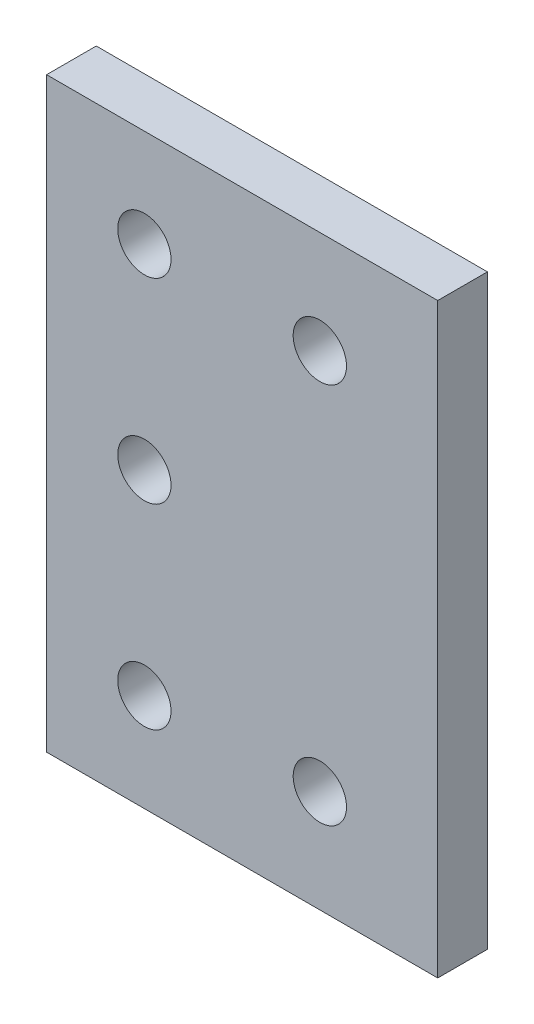
ISO-10303-21;
HEADER;
FILE_DESCRIPTION(('STEP AP214'),'2;1');
FILE_NAME('part.step','',(''),(''),'','','');
FILE_SCHEMA(('AUTOMOTIVE_DESIGN { 1 0 10303 214 1 1 1 1 }'));
ENDSEC;
DATA;
#1=APPLICATION_CONTEXT('core data for automotive mechanical design processes');
#2=APPLICATION_PROTOCOL_DEFINITION('international standard','automotive_design',2000,#1);
#3=PRODUCT_CONTEXT('',#1,'mechanical');
#4=PRODUCT('Part','Part','',(#3));
#5=PRODUCT_RELATED_PRODUCT_CATEGORY('part','',(#4));
#6=PRODUCT_DEFINITION_FORMATION('','',#4);
#7=PRODUCT_DEFINITION_CONTEXT('part definition',#1,'design');
#8=PRODUCT_DEFINITION('design','',#6,#7);
#9=PRODUCT_DEFINITION_SHAPE('','',#8);
#10=(LENGTH_UNIT() NAMED_UNIT(*) SI_UNIT(.MILLI.,.METRE.));
#11=(NAMED_UNIT(*) PLANE_ANGLE_UNIT() SI_UNIT($,.RADIAN.));
#12=(NAMED_UNIT(*) SI_UNIT($,.STERADIAN.) SOLID_ANGLE_UNIT());
#13=UNCERTAINTY_MEASURE_WITH_UNIT(LENGTH_MEASURE(1.E-05),#10,'distance_accuracy_value','');
#14=(GEOMETRIC_REPRESENTATION_CONTEXT(3) GLOBAL_UNCERTAINTY_ASSIGNED_CONTEXT((#13)) GLOBAL_UNIT_ASSIGNED_CONTEXT((#10,
#11,#12)) REPRESENTATION_CONTEXT('',''));
#15=CARTESIAN_POINT('',(0.,0.,0.));
#16=DIRECTION('',(0.,0.,1.));
#17=DIRECTION('',(1.,0.,0.));
#18=AXIS2_PLACEMENT_3D('',#15,#16,#17);
#19=CARTESIAN_POINT('',(-25.,37.5,6.35));
#20=DIRECTION('',(1.,0.,0.));
#21=DIRECTION('',(0.,1.,0.));
#22=AXIS2_PLACEMENT_3D('',#19,#20,#21);
#23=PLANE('',#22);
#24=DIRECTION('',(0.,-1.,0.));
#25=VECTOR('',#24,1.);
#26=CARTESIAN_POINT('',(-25.,37.5,0.));
#27=LINE('',#26,#25);
#28=CARTESIAN_POINT('',(-25.,37.5,0.));
#29=VERTEX_POINT('',#28);
#30=CARTESIAN_POINT('',(-25.,-37.5,0.));
#31=VERTEX_POINT('',#30);
#32=EDGE_CURVE('E97',#29,#31,#27,.T.);
#33=ORIENTED_EDGE('',*,*,#32,.T.);
#34=DIRECTION('',(0.,0.,-1.));
#35=VECTOR('',#34,1.);
#36=CARTESIAN_POINT('',(-25.,-37.5,6.35));
#37=LINE('',#36,#35);
#38=CARTESIAN_POINT('',(-25.,-37.5,6.35));
#39=VERTEX_POINT('',#38);
#40=EDGE_CURVE('E11',#39,#31,#37,.T.);
#41=ORIENTED_EDGE('',*,*,#40,.F.);
#42=DIRECTION('',(0.,-1.,0.));
#43=VECTOR('',#42,1.);
#44=CARTESIAN_POINT('',(-25.,37.5,6.35));
#45=LINE('',#44,#43);
#46=CARTESIAN_POINT('',(-25.,37.5,6.35));
#47=VERTEX_POINT('',#46);
#48=EDGE_CURVE('E85',#47,#39,#45,.T.);
#49=ORIENTED_EDGE('',*,*,#48,.F.);
#50=DIRECTION('',(0.,0.,-1.));
#51=VECTOR('',#50,1.);
#52=CARTESIAN_POINT('',(-25.,37.5,6.35));
#53=LINE('',#52,#51);
#54=EDGE_CURVE('E93',#47,#29,#53,.T.);
#55=ORIENTED_EDGE('',*,*,#54,.T.);
#56=EDGE_LOOP('',(#33,#41,#49,#55));
#57=FACE_BOUND('',#56,.T.);
#58=ADVANCED_FACE('F34',(#57),#23,.F.);
#59=CARTESIAN_POINT('',(-25.,-37.5,6.35));
#60=DIRECTION('',(0.,1.,0.));
#61=DIRECTION('',(0.,0.,1.));
#62=AXIS2_PLACEMENT_3D('',#59,#60,#61);
#63=PLANE('',#62);
#64=DIRECTION('',(1.,0.,0.));
#65=VECTOR('',#64,1.);
#66=CARTESIAN_POINT('',(-25.,-37.5,0.));
#67=LINE('',#66,#65);
#68=CARTESIAN_POINT('',(25.,-37.5,0.));
#69=VERTEX_POINT('',#68);
#70=EDGE_CURVE('E89',#31,#69,#67,.T.);
#71=ORIENTED_EDGE('',*,*,#70,.T.);
#72=DIRECTION('',(0.,0.,-1.));
#73=VECTOR('',#72,1.);
#74=CARTESIAN_POINT('',(25.,-37.5,6.35));
#75=LINE('',#74,#73);
#76=CARTESIAN_POINT('',(25.,-37.5,6.35));
#77=VERTEX_POINT('',#76);
#78=EDGE_CURVE('E42',#77,#69,#75,.T.);
#79=ORIENTED_EDGE('',*,*,#78,.F.);
#80=DIRECTION('',(1.,0.,0.));
#81=VECTOR('',#80,1.);
#82=CARTESIAN_POINT('',(-25.,-37.5,6.35));
#83=LINE('',#82,#81);
#84=EDGE_CURVE('E80',#39,#77,#83,.T.);
#85=ORIENTED_EDGE('',*,*,#84,.F.);
#86=ORIENTED_EDGE('',*,*,#40,.T.);
#87=EDGE_LOOP('',(#71,#79,#85,#86));
#88=FACE_BOUND('',#87,.T.);
#89=ADVANCED_FACE('F88',(#88),#63,.F.);
#90=CARTESIAN_POINT('',(25.,37.5,6.35));
#91=DIRECTION('',(-1.,0.,0.));
#92=DIRECTION('',(0.,0.,1.));
#93=AXIS2_PLACEMENT_3D('',#90,#91,#92);
#94=PLANE('',#93);
#95=DIRECTION('',(0.,1.,0.));
#96=VECTOR('',#95,1.);
#97=CARTESIAN_POINT('',(25.,37.5,0.));
#98=LINE('',#97,#96);
#99=CARTESIAN_POINT('',(25.,37.5,0.));
#100=VERTEX_POINT('',#99);
#101=EDGE_CURVE('E67',#69,#100,#98,.T.);
#102=ORIENTED_EDGE('',*,*,#101,.T.);
#103=DIRECTION('',(0.,0.,-1.));
#104=VECTOR('',#103,1.);
#105=CARTESIAN_POINT('',(25.,37.5,6.35));
#106=LINE('',#105,#104);
#107=CARTESIAN_POINT('',(25.,37.5,6.35));
#108=VERTEX_POINT('',#107);
#109=EDGE_CURVE('E90',#108,#100,#106,.T.);
#110=ORIENTED_EDGE('',*,*,#109,.F.);
#111=DIRECTION('',(0.,1.,0.));
#112=VECTOR('',#111,1.);
#113=CARTESIAN_POINT('',(25.,37.5,6.35));
#114=LINE('',#113,#112);
#115=EDGE_CURVE('E83',#77,#108,#114,.T.);
#116=ORIENTED_EDGE('',*,*,#115,.F.);
#117=ORIENTED_EDGE('',*,*,#78,.T.);
#118=EDGE_LOOP('',(#102,#110,#116,#117));
#119=FACE_BOUND('',#118,.T.);
#120=ADVANCED_FACE('F91',(#119),#94,.F.);
#121=CARTESIAN_POINT('',(-25.,37.5,6.35));
#122=DIRECTION('',(0.,-1.,0.));
#123=DIRECTION('',(0.,0.,-1.));
#124=AXIS2_PLACEMENT_3D('',#121,#122,#123);
#125=PLANE('',#124);
#126=DIRECTION('',(-1.,0.,0.));
#127=VECTOR('',#126,1.);
#128=CARTESIAN_POINT('',(-25.,37.5,0.));
#129=LINE('',#128,#127);
#130=EDGE_CURVE('E73',#100,#29,#129,.T.);
#131=ORIENTED_EDGE('',*,*,#130,.T.);
#132=ORIENTED_EDGE('',*,*,#54,.F.);
#133=DIRECTION('',(-1.,0.,0.));
#134=VECTOR('',#133,1.);
#135=CARTESIAN_POINT('',(-25.,37.5,6.35));
#136=LINE('',#135,#134);
#137=EDGE_CURVE('E50',#108,#47,#136,.T.);
#138=ORIENTED_EDGE('',*,*,#137,.F.);
#139=ORIENTED_EDGE('',*,*,#109,.T.);
#140=EDGE_LOOP('',(#131,#132,#138,#139));
#141=FACE_BOUND('',#140,.T.);
#142=ADVANCED_FACE('F105',(#141),#125,.F.);
#143=CARTESIAN_POINT('',(0.,0.,6.35));
#144=DIRECTION('',(0.,0.,1.));
#145=DIRECTION('',(1.,0.,0.));
#146=AXIS2_PLACEMENT_3D('',#143,#144,#145);
#147=PLANE('',#146);
#148=CARTESIAN_POINT('',(9.929,-24.4,6.35));
#149=DIRECTION('',(0.,0.,1.));
#150=DIRECTION('',(1.,0.,0.));
#151=AXIS2_PLACEMENT_3D('',#148,#149,#150);
#152=CIRCLE('',#151,3.405);
#153=CARTESIAN_POINT('',(13.334,-24.4,6.35));
#154=VERTEX_POINT('',#153);
#155=EDGE_CURVE('E117',#154,#154,#152,.T.);
#156=ORIENTED_EDGE('',*,*,#155,.F.);
#157=EDGE_LOOP('',(#156));
#158=FACE_BOUND('',#157,.T.);
#159=CARTESIAN_POINT('',(-12.5,-25.,6.35));
#160=DIRECTION('',(0.,0.,1.));
#161=DIRECTION('',(1.,0.,0.));
#162=AXIS2_PLACEMENT_3D('',#159,#160,#161);
#163=CIRCLE('',#162,3.405);
#164=CARTESIAN_POINT('',(-9.095,-25.,6.35));
#165=VERTEX_POINT('',#164);
#166=EDGE_CURVE('E123',#165,#165,#163,.T.);
#167=ORIENTED_EDGE('',*,*,#166,.F.);
#168=EDGE_LOOP('',(#167));
#169=FACE_BOUND('',#168,.T.);
#170=CARTESIAN_POINT('',(-12.5,0.,6.35));
#171=DIRECTION('',(0.,0.,1.));
#172=DIRECTION('',(1.,0.,0.));
#173=AXIS2_PLACEMENT_3D('',#170,#171,#172);
#174=CIRCLE('',#173,3.405);
#175=CARTESIAN_POINT('',(-9.095,0.,6.35));
#176=VERTEX_POINT('',#175);
#177=EDGE_CURVE('E129',#176,#176,#174,.T.);
#178=ORIENTED_EDGE('',*,*,#177,.F.);
#179=EDGE_LOOP('',(#178));
#180=FACE_BOUND('',#179,.T.);
#181=CARTESIAN_POINT('',(9.929,24.4,6.35));
#182=DIRECTION('',(0.,0.,1.));
#183=DIRECTION('',(1.,0.,0.));
#184=AXIS2_PLACEMENT_3D('',#181,#182,#183);
#185=CIRCLE('',#184,3.405);
#186=CARTESIAN_POINT('',(13.334,24.4,6.35));
#187=VERTEX_POINT('',#186);
#188=EDGE_CURVE('E135',#187,#187,#185,.T.);
#189=ORIENTED_EDGE('',*,*,#188,.F.);
#190=EDGE_LOOP('',(#189));
#191=FACE_BOUND('',#190,.T.);
#192=CARTESIAN_POINT('',(-12.5,25.,6.35));
#193=DIRECTION('',(0.,0.,1.));
#194=DIRECTION('',(1.,0.,0.));
#195=AXIS2_PLACEMENT_3D('',#192,#193,#194);
#196=CIRCLE('',#195,3.405);
#197=CARTESIAN_POINT('',(-9.095,25.,6.35));
#198=VERTEX_POINT('',#197);
#199=EDGE_CURVE('E111',#198,#198,#196,.T.);
#200=ORIENTED_EDGE('',*,*,#199,.F.);
#201=EDGE_LOOP('',(#200));
#202=FACE_BOUND('',#201,.T.);
#203=ORIENTED_EDGE('',*,*,#48,.T.);
#204=ORIENTED_EDGE('',*,*,#84,.T.);
#205=ORIENTED_EDGE('',*,*,#115,.T.);
#206=ORIENTED_EDGE('',*,*,#137,.T.);
#207=EDGE_LOOP('',(#203,#204,#205,#206));
#208=FACE_BOUND('',#207,.T.);
#209=ADVANCED_FACE('F81',(#158,#169,#180,#191,#202,#208),#147,.T.);
#210=CARTESIAN_POINT('',(0.,0.,0.));
#211=DIRECTION('',(0.,0.,1.));
#212=DIRECTION('',(1.,0.,0.));
#213=AXIS2_PLACEMENT_3D('',#210,#211,#212);
#214=PLANE('',#213);
#215=CARTESIAN_POINT('',(9.929,-24.4,0.));
#216=DIRECTION('',(0.,0.,1.));
#217=DIRECTION('',(1.,0.,0.));
#218=AXIS2_PLACEMENT_3D('',#215,#216,#217);
#219=CIRCLE('',#218,3.405);
#220=CARTESIAN_POINT('',(13.334,-24.4,0.));
#221=VERTEX_POINT('',#220);
#222=EDGE_CURVE('E120',#221,#221,#219,.T.);
#223=ORIENTED_EDGE('',*,*,#222,.T.);
#224=EDGE_LOOP('',(#223));
#225=FACE_BOUND('',#224,.T.);
#226=CARTESIAN_POINT('',(-12.5,-25.,0.));
#227=DIRECTION('',(0.,0.,1.));
#228=DIRECTION('',(1.,0.,0.));
#229=AXIS2_PLACEMENT_3D('',#226,#227,#228);
#230=CIRCLE('',#229,3.405);
#231=CARTESIAN_POINT('',(-9.095,-25.,0.));
#232=VERTEX_POINT('',#231);
#233=EDGE_CURVE('E126',#232,#232,#230,.T.);
#234=ORIENTED_EDGE('',*,*,#233,.T.);
#235=EDGE_LOOP('',(#234));
#236=FACE_BOUND('',#235,.T.);
#237=CARTESIAN_POINT('',(-12.5,0.,0.));
#238=DIRECTION('',(0.,0.,1.));
#239=DIRECTION('',(1.,0.,0.));
#240=AXIS2_PLACEMENT_3D('',#237,#238,#239);
#241=CIRCLE('',#240,3.405);
#242=CARTESIAN_POINT('',(-9.095,0.,0.));
#243=VERTEX_POINT('',#242);
#244=EDGE_CURVE('E132',#243,#243,#241,.T.);
#245=ORIENTED_EDGE('',*,*,#244,.T.);
#246=EDGE_LOOP('',(#245));
#247=FACE_BOUND('',#246,.T.);
#248=CARTESIAN_POINT('',(9.929,24.4,0.));
#249=DIRECTION('',(0.,0.,1.));
#250=DIRECTION('',(1.,0.,0.));
#251=AXIS2_PLACEMENT_3D('',#248,#249,#250);
#252=CIRCLE('',#251,3.405);
#253=CARTESIAN_POINT('',(13.334,24.4,0.));
#254=VERTEX_POINT('',#253);
#255=EDGE_CURVE('E114',#254,#254,#252,.T.);
#256=ORIENTED_EDGE('',*,*,#255,.T.);
#257=EDGE_LOOP('',(#256));
#258=FACE_BOUND('',#257,.T.);
#259=CARTESIAN_POINT('',(-12.5,25.,0.));
#260=DIRECTION('',(0.,0.,1.));
#261=DIRECTION('',(1.,0.,0.));
#262=AXIS2_PLACEMENT_3D('',#259,#260,#261);
#263=CIRCLE('',#262,3.405);
#264=CARTESIAN_POINT('',(-9.095,25.,0.));
#265=VERTEX_POINT('',#264);
#266=EDGE_CURVE('E100',#265,#265,#263,.T.);
#267=ORIENTED_EDGE('',*,*,#266,.T.);
#268=EDGE_LOOP('',(#267));
#269=FACE_BOUND('',#268,.T.);
#270=ORIENTED_EDGE('',*,*,#32,.F.);
#271=ORIENTED_EDGE('',*,*,#130,.F.);
#272=ORIENTED_EDGE('',*,*,#101,.F.);
#273=ORIENTED_EDGE('',*,*,#70,.F.);
#274=EDGE_LOOP('',(#270,#271,#272,#273));
#275=FACE_BOUND('',#274,.T.);
#276=ADVANCED_FACE('F108',(#225,#236,#247,#258,#269,#275),#214,.F.);
#277=CARTESIAN_POINT('',(-12.5,25.,0.));
#278=DIRECTION('',(0.,0.,1.));
#279=DIRECTION('',(1.,0.,0.));
#280=AXIS2_PLACEMENT_3D('',#277,#278,#279);
#281=CYLINDRICAL_SURFACE('',#280,3.405);
#282=ORIENTED_EDGE('',*,*,#266,.F.);
#283=EDGE_LOOP('',(#282));
#284=FACE_BOUND('',#283,.T.);
#285=ORIENTED_EDGE('',*,*,#199,.T.);
#286=EDGE_LOOP('',(#285));
#287=FACE_BOUND('',#286,.T.);
#288=ADVANCED_FACE('F147',(#284,#287),#281,.F.);
#289=CARTESIAN_POINT('',(9.929,24.4,0.));
#290=DIRECTION('',(0.,0.,1.));
#291=DIRECTION('',(1.,0.,0.));
#292=AXIS2_PLACEMENT_3D('',#289,#290,#291);
#293=CYLINDRICAL_SURFACE('',#292,3.405);
#294=ORIENTED_EDGE('',*,*,#255,.F.);
#295=EDGE_LOOP('',(#294));
#296=FACE_BOUND('',#295,.T.);
#297=ORIENTED_EDGE('',*,*,#188,.T.);
#298=EDGE_LOOP('',(#297));
#299=FACE_BOUND('',#298,.T.);
#300=ADVANCED_FACE('F143',(#296,#299),#293,.F.);
#301=CARTESIAN_POINT('',(-12.5,0.,0.));
#302=DIRECTION('',(0.,0.,1.));
#303=DIRECTION('',(1.,0.,0.));
#304=AXIS2_PLACEMENT_3D('',#301,#302,#303);
#305=CYLINDRICAL_SURFACE('',#304,3.405);
#306=ORIENTED_EDGE('',*,*,#244,.F.);
#307=EDGE_LOOP('',(#306));
#308=FACE_BOUND('',#307,.T.);
#309=ORIENTED_EDGE('',*,*,#177,.T.);
#310=EDGE_LOOP('',(#309));
#311=FACE_BOUND('',#310,.T.);
#312=ADVANCED_FACE('F146',(#308,#311),#305,.F.);
#313=CARTESIAN_POINT('',(-12.5,-25.,0.));
#314=DIRECTION('',(0.,0.,1.));
#315=DIRECTION('',(1.,0.,0.));
#316=AXIS2_PLACEMENT_3D('',#313,#314,#315);
#317=CYLINDRICAL_SURFACE('',#316,3.405);
#318=ORIENTED_EDGE('',*,*,#233,.F.);
#319=EDGE_LOOP('',(#318));
#320=FACE_BOUND('',#319,.T.);
#321=ORIENTED_EDGE('',*,*,#166,.T.);
#322=EDGE_LOOP('',(#321));
#323=FACE_BOUND('',#322,.T.);
#324=ADVANCED_FACE('F208',(#320,#323),#317,.F.);
#325=CARTESIAN_POINT('',(9.929,-24.4,0.));
#326=DIRECTION('',(0.,0.,1.));
#327=DIRECTION('',(1.,0.,0.));
#328=AXIS2_PLACEMENT_3D('',#325,#326,#327);
#329=CYLINDRICAL_SURFACE('',#328,3.405);
#330=ORIENTED_EDGE('',*,*,#222,.F.);
#331=EDGE_LOOP('',(#330));
#332=FACE_BOUND('',#331,.T.);
#333=ORIENTED_EDGE('',*,*,#155,.T.);
#334=EDGE_LOOP('',(#333));
#335=FACE_BOUND('',#334,.T.);
#336=ADVANCED_FACE('F218',(#332,#335),#329,.F.);
#337=CLOSED_SHELL('',(#58,#89,#120,#142,#209,#276,#288,#300,#312,#324,#336));
#338=MANIFOLD_SOLID_BREP('B2',#337);
#339=ADVANCED_BREP_SHAPE_REPRESENTATION('',(#18,#338),#14);
#340=SHAPE_DEFINITION_REPRESENTATION(#9,#339);
ENDSEC;
END-ISO-10303-21;
